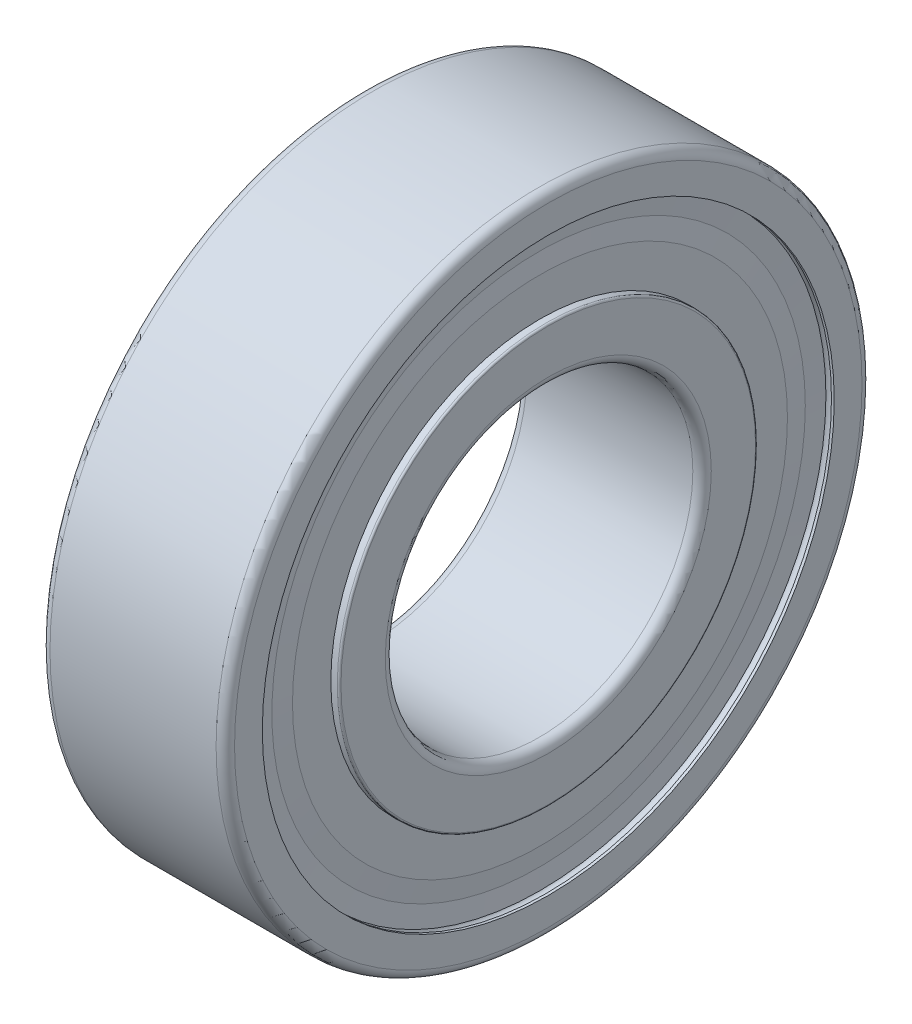
ISO-10303-21;
HEADER;
FILE_DESCRIPTION(('STEP AP214'),'2;1');
FILE_NAME('part.step','',(''),(''),'','','');
FILE_SCHEMA(('AUTOMOTIVE_DESIGN { 1 0 10303 214 1 1 1 1 }'));
ENDSEC;
DATA;
#1=APPLICATION_CONTEXT('core data for automotive mechanical design processes');
#2=APPLICATION_PROTOCOL_DEFINITION('international standard','automotive_design',2000,#1);
#3=PRODUCT_CONTEXT('',#1,'mechanical');
#4=PRODUCT('Part','Part','',(#3));
#5=PRODUCT_RELATED_PRODUCT_CATEGORY('part','',(#4));
#6=PRODUCT_DEFINITION_FORMATION('','',#4);
#7=PRODUCT_DEFINITION_CONTEXT('part definition',#1,'design');
#8=PRODUCT_DEFINITION('design','',#6,#7);
#9=PRODUCT_DEFINITION_SHAPE('','',#8);
#10=(LENGTH_UNIT() NAMED_UNIT(*) SI_UNIT(.MILLI.,.METRE.));
#11=(NAMED_UNIT(*) PLANE_ANGLE_UNIT() SI_UNIT($,.RADIAN.));
#12=(NAMED_UNIT(*) SI_UNIT($,.STERADIAN.) SOLID_ANGLE_UNIT());
#13=UNCERTAINTY_MEASURE_WITH_UNIT(LENGTH_MEASURE(1.E-05),#10,'distance_accuracy_value','');
#14=(GEOMETRIC_REPRESENTATION_CONTEXT(3) GLOBAL_UNCERTAINTY_ASSIGNED_CONTEXT((#13)) GLOBAL_UNIT_ASSIGNED_CONTEXT((#10,
#11,#12)) REPRESENTATION_CONTEXT('',''));
#15=CARTESIAN_POINT('',(0.,0.,0.));
#16=DIRECTION('',(0.,0.,1.));
#17=DIRECTION('',(1.,0.,0.));
#18=AXIS2_PLACEMENT_3D('',#15,#16,#17);
#19=CARTESIAN_POINT('',(50.,0.,0.));
#20=DIRECTION('',(1.,0.,0.));
#21=DIRECTION('',(0.,0.,-1.));
#22=AXIS2_PLACEMENT_3D('',#19,#20,#21);
#23=CYLINDRICAL_SURFACE('',#22,18.595);
#24=CARTESIAN_POINT('',(11.46,0.,0.));
#25=DIRECTION('',(1.,0.,0.));
#26=DIRECTION('',(0.,0.,-1.));
#27=AXIS2_PLACEMENT_3D('',#24,#25,#26);
#28=CIRCLE('',#27,18.595);
#29=CARTESIAN_POINT('',(11.46,0.,-18.595));
#30=VERTEX_POINT('',#29);
#31=EDGE_CURVE('P0_E11',#30,#30,#28,.T.);
#32=ORIENTED_EDGE('',*,*,#31,.F.);
#33=EDGE_LOOP('',(#32));
#34=FACE_BOUND('',#33,.T.);
#35=CARTESIAN_POINT('',(11.28,0.,0.));
#36=DIRECTION('',(1.,0.,0.));
#37=DIRECTION('',(0.,0.,-1.));
#38=AXIS2_PLACEMENT_3D('',#35,#36,#37);
#39=CIRCLE('',#38,18.595);
#40=CARTESIAN_POINT('',(11.28,0.,-18.595));
#41=VERTEX_POINT('',#40);
#42=EDGE_CURVE('P0_E186',#41,#41,#39,.T.);
#43=ORIENTED_EDGE('',*,*,#42,.T.);
#44=EDGE_LOOP('',(#43));
#45=FACE_BOUND('',#44,.T.);
#46=ADVANCED_FACE('P0_F16',(#34,#45),#23,.T.);
#47=CARTESIAN_POINT('',(11.37,0.,0.));
#48=DIRECTION('',(1.,0.,0.));
#49=DIRECTION('',(0.,0.,-1.));
#50=AXIS2_PLACEMENT_3D('',#47,#48,#49);
#51=CONICAL_SURFACE('',#50,17.34375,1.49899191472693);
#52=CARTESIAN_POINT('',(11.37,0.,0.));
#53=DIRECTION('',(1.,0.,0.));
#54=DIRECTION('',(0.,0.,-1.));
#55=AXIS2_PLACEMENT_3D('',#52,#53,#54);
#56=CIRCLE('',#55,17.34375);
#57=CARTESIAN_POINT('',(11.37,0.,-17.34375));
#58=VERTEX_POINT('',#57);
#59=EDGE_CURVE('P0_E27',#58,#58,#56,.T.);
#60=ORIENTED_EDGE('',*,*,#59,.F.);
#61=EDGE_LOOP('',(#60));
#62=FACE_BOUND('',#61,.T.);
#63=ORIENTED_EDGE('',*,*,#31,.T.);
#64=EDGE_LOOP('',(#63));
#65=FACE_BOUND('',#64,.T.);
#66=ADVANCED_FACE('P0_F267',(#62,#65),#51,.F.);
#67=CARTESIAN_POINT('',(11.46,0.,0.));
#68=DIRECTION('',(-1.,0.,0.));
#69=DIRECTION('',(0.,0.,1.));
#70=AXIS2_PLACEMENT_3D('',#67,#68,#69);
#71=CONICAL_SURFACE('',#70,16.0925,1.49899191472693);
#72=CARTESIAN_POINT('',(11.46,0.,0.));
#73=DIRECTION('',(1.,0.,0.));
#74=DIRECTION('',(0.,0.,-1.));
#75=AXIS2_PLACEMENT_3D('',#72,#73,#74);
#76=CIRCLE('',#75,16.0925);
#77=CARTESIAN_POINT('',(11.46,0.,-16.0925));
#78=VERTEX_POINT('',#77);
#79=EDGE_CURVE('P0_E168',#78,#78,#76,.T.);
#80=ORIENTED_EDGE('',*,*,#79,.F.);
#81=EDGE_LOOP('',(#80));
#82=FACE_BOUND('',#81,.T.);
#83=ORIENTED_EDGE('',*,*,#59,.T.);
#84=EDGE_LOOP('',(#83));
#85=FACE_BOUND('',#84,.T.);
#86=ADVANCED_FACE('P0_F18',(#82,#85),#71,.T.);
#87=CARTESIAN_POINT('',(11.46,13.59,0.));
#88=DIRECTION('',(1.,0.,0.));
#89=DIRECTION('',(0.,1.,0.));
#90=AXIS2_PLACEMENT_3D('',#87,#88,#89);
#91=PLANE('',#90);
#92=CARTESIAN_POINT('',(11.46,0.,0.));
#93=DIRECTION('',(-1.,0.,0.));
#94=DIRECTION('',(0.,0.,-1.));
#95=AXIS2_PLACEMENT_3D('',#92,#93,#94);
#96=CIRCLE('',#95,13.6);
#97=CARTESIAN_POINT('',(11.46,0.,-13.6));
#98=VERTEX_POINT('',#97);
#99=EDGE_CURVE('P0_E90',#98,#98,#96,.T.);
#100=ORIENTED_EDGE('',*,*,#99,.T.);
#101=EDGE_LOOP('',(#100));
#102=FACE_BOUND('',#101,.T.);
#103=ORIENTED_EDGE('',*,*,#79,.T.);
#104=EDGE_LOOP('',(#103));
#105=FACE_BOUND('',#104,.T.);
#106=ADVANCED_FACE('P0_F297',(#102,#105),#91,.T.);
#107=CARTESIAN_POINT('',(11.1,0.,0.));
#108=DIRECTION('',(-1.,0.,0.));
#109=DIRECTION('',(0.,0.,1.));
#110=AXIS2_PLACEMENT_3D('',#107,#108,#109);
#111=CONICAL_SURFACE('',#110,16.0925,1.49899191472693);
#112=CARTESIAN_POINT('',(11.1,0.,0.));
#113=DIRECTION('',(1.,0.,0.));
#114=DIRECTION('',(0.,0.,-1.));
#115=AXIS2_PLACEMENT_3D('',#112,#113,#114);
#116=CIRCLE('',#115,16.0925);
#117=CARTESIAN_POINT('',(11.1,0.,-16.0925));
#118=VERTEX_POINT('',#117);
#119=EDGE_CURVE('P0_E20',#118,#118,#116,.T.);
#120=ORIENTED_EDGE('',*,*,#119,.F.);
#121=EDGE_LOOP('',(#120));
#122=FACE_BOUND('',#121,.T.);
#123=CARTESIAN_POINT('',(11.2792807192807,0.,0.));
#124=DIRECTION('',(1.,0.,0.));
#125=DIRECTION('',(0.,0.,1.));
#126=AXIS2_PLACEMENT_3D('',#123,#124,#125);
#127=CIRCLE('',#126,13.6);
#128=CARTESIAN_POINT('',(11.2792807192807,0.,13.6));
#129=VERTEX_POINT('',#128);
#130=EDGE_CURVE('P0_E176',#129,#129,#127,.T.);
#131=ORIENTED_EDGE('',*,*,#130,.T.);
#132=EDGE_LOOP('',(#131));
#133=FACE_BOUND('',#132,.T.);
#134=ADVANCED_FACE('P0_F222',(#122,#133),#111,.F.);
#135=CARTESIAN_POINT('',(11.1,17.34375,0.));
#136=DIRECTION('',(-1.,0.,0.));
#137=DIRECTION('',(0.,0.,1.));
#138=AXIS2_PLACEMENT_3D('',#135,#136,#137);
#139=PLANE('',#138);
#140=CARTESIAN_POINT('',(11.1,0.,0.));
#141=DIRECTION('',(1.,0.,0.));
#142=DIRECTION('',(0.,0.,-1.));
#143=AXIS2_PLACEMENT_3D('',#140,#141,#142);
#144=CIRCLE('',#143,17.34375);
#145=CARTESIAN_POINT('',(11.1,0.,-17.34375));
#146=VERTEX_POINT('',#145);
#147=EDGE_CURVE('P0_E184',#146,#146,#144,.T.);
#148=ORIENTED_EDGE('',*,*,#147,.F.);
#149=EDGE_LOOP('',(#148));
#150=FACE_BOUND('',#149,.T.);
#151=ORIENTED_EDGE('',*,*,#119,.T.);
#152=EDGE_LOOP('',(#151));
#153=FACE_BOUND('',#152,.T.);
#154=ADVANCED_FACE('P0_F219',(#150,#153),#139,.T.);
#155=CARTESIAN_POINT('',(11.28,0.,0.));
#156=DIRECTION('',(1.,0.,0.));
#157=DIRECTION('',(0.,0.,-1.));
#158=AXIS2_PLACEMENT_3D('',#155,#156,#157);
#159=CONICAL_SURFACE('',#158,18.595,1.42792038843124);
#160=ORIENTED_EDGE('',*,*,#42,.F.);
#161=EDGE_LOOP('',(#160));
#162=FACE_BOUND('',#161,.T.);
#163=ORIENTED_EDGE('',*,*,#147,.T.);
#164=EDGE_LOOP('',(#163));
#165=FACE_BOUND('',#164,.T.);
#166=ADVANCED_FACE('P0_F217',(#162,#165),#159,.T.);
#167=CARTESIAN_POINT('',(0.9,0.,0.));
#168=DIRECTION('',(-1.,0.,0.));
#169=DIRECTION('',(0.,0.,1.));
#170=AXIS2_PLACEMENT_3D('',#167,#168,#169);
#171=CONICAL_SURFACE('',#170,17.34375,1.42792038843124);
#172=CARTESIAN_POINT('',(0.9,0.,0.));
#173=DIRECTION('',(1.,0.,0.));
#174=DIRECTION('',(0.,0.,-1.));
#175=AXIS2_PLACEMENT_3D('',#172,#173,#174);
#176=CIRCLE('',#175,17.34375);
#177=CARTESIAN_POINT('',(0.9,0.,-17.34375));
#178=VERTEX_POINT('',#177);
#179=EDGE_CURVE('P0_E181',#178,#178,#176,.T.);
#180=ORIENTED_EDGE('',*,*,#179,.F.);
#181=EDGE_LOOP('',(#180));
#182=FACE_BOUND('',#181,.T.);
#183=CARTESIAN_POINT('',(0.72,0.,0.));
#184=DIRECTION('',(1.,0.,0.));
#185=DIRECTION('',(0.,0.,-1.));
#186=AXIS2_PLACEMENT_3D('',#183,#184,#185);
#187=CIRCLE('',#186,18.595);
#188=CARTESIAN_POINT('',(0.72,0.,-18.595));
#189=VERTEX_POINT('',#188);
#190=EDGE_CURVE('P0_E192',#189,#189,#187,.T.);
#191=ORIENTED_EDGE('',*,*,#190,.T.);
#192=EDGE_LOOP('',(#191));
#193=FACE_BOUND('',#192,.T.);
#194=ADVANCED_FACE('P0_F315',(#182,#193),#171,.T.);
#195=CARTESIAN_POINT('',(0.9,16.0925,0.));
#196=DIRECTION('',(1.,0.,0.));
#197=DIRECTION('',(0.,1.,0.));
#198=AXIS2_PLACEMENT_3D('',#195,#196,#197);
#199=PLANE('',#198);
#200=CARTESIAN_POINT('',(0.9,0.,0.));
#201=DIRECTION('',(1.,0.,0.));
#202=DIRECTION('',(0.,0.,-1.));
#203=AXIS2_PLACEMENT_3D('',#200,#201,#202);
#204=CIRCLE('',#203,16.0925);
#205=CARTESIAN_POINT('',(0.9,0.,-16.0925));
#206=VERTEX_POINT('',#205);
#207=EDGE_CURVE('P0_E185',#206,#206,#204,.T.);
#208=ORIENTED_EDGE('',*,*,#207,.F.);
#209=EDGE_LOOP('',(#208));
#210=FACE_BOUND('',#209,.T.);
#211=ORIENTED_EDGE('',*,*,#179,.T.);
#212=EDGE_LOOP('',(#211));
#213=FACE_BOUND('',#212,.T.);
#214=ADVANCED_FACE('P0_F283',(#210,#213),#199,.T.);
#215=CARTESIAN_POINT('',(0.72,0.,0.));
#216=DIRECTION('',(1.,0.,0.));
#217=DIRECTION('',(0.,0.,-1.));
#218=AXIS2_PLACEMENT_3D('',#215,#216,#217);
#219=CONICAL_SURFACE('',#218,13.59,1.49899191472693);
#220=CARTESIAN_POINT('',(0.720719280719279,0.,0.));
#221=DIRECTION('',(-1.,0.,0.));
#222=DIRECTION('',(0.,0.,-1.));
#223=AXIS2_PLACEMENT_3D('',#220,#221,#222);
#224=CIRCLE('',#223,13.6);
#225=CARTESIAN_POINT('',(0.720719280719279,0.,-13.6));
#226=VERTEX_POINT('',#225);
#227=EDGE_CURVE('P0_E202',#226,#226,#224,.T.);
#228=ORIENTED_EDGE('',*,*,#227,.T.);
#229=EDGE_LOOP('',(#228));
#230=FACE_BOUND('',#229,.T.);
#231=ORIENTED_EDGE('',*,*,#207,.T.);
#232=EDGE_LOOP('',(#231));
#233=FACE_BOUND('',#232,.T.);
#234=ADVANCED_FACE('P0_F279',(#230,#233),#219,.F.);
#235=CARTESIAN_POINT('',(0.54,16.0925,0.));
#236=DIRECTION('',(-1.,0.,0.));
#237=DIRECTION('',(0.,0.,1.));
#238=AXIS2_PLACEMENT_3D('',#235,#236,#237);
#239=PLANE('',#238);
#240=CARTESIAN_POINT('',(0.54,0.,0.));
#241=DIRECTION('',(1.,0.,0.));
#242=DIRECTION('',(0.,0.,-1.));
#243=AXIS2_PLACEMENT_3D('',#240,#241,#242);
#244=CIRCLE('',#243,16.0925);
#245=CARTESIAN_POINT('',(0.54,0.,-16.0925));
#246=VERTEX_POINT('',#245);
#247=EDGE_CURVE('P0_E189',#246,#246,#244,.T.);
#248=ORIENTED_EDGE('',*,*,#247,.F.);
#249=EDGE_LOOP('',(#248));
#250=FACE_BOUND('',#249,.T.);
#251=CARTESIAN_POINT('',(0.54,0.,0.));
#252=DIRECTION('',(1.,0.,0.));
#253=DIRECTION('',(0.,0.,1.));
#254=AXIS2_PLACEMENT_3D('',#251,#252,#253);
#255=CIRCLE('',#254,13.6);
#256=CARTESIAN_POINT('',(0.54,0.,13.6));
#257=VERTEX_POINT('',#256);
#258=EDGE_CURVE('P0_E171',#257,#257,#255,.T.);
#259=ORIENTED_EDGE('',*,*,#258,.T.);
#260=EDGE_LOOP('',(#259));
#261=FACE_BOUND('',#260,.T.);
#262=ADVANCED_FACE('P0_F282',(#250,#261),#239,.T.);
#263=CARTESIAN_POINT('',(0.63,0.,0.));
#264=DIRECTION('',(1.,0.,0.));
#265=DIRECTION('',(0.,0.,-1.));
#266=AXIS2_PLACEMENT_3D('',#263,#264,#265);
#267=CONICAL_SURFACE('',#266,17.34375,1.49899191472693);
#268=CARTESIAN_POINT('',(0.63,0.,0.));
#269=DIRECTION('',(1.,0.,0.));
#270=DIRECTION('',(0.,0.,-1.));
#271=AXIS2_PLACEMENT_3D('',#268,#269,#270);
#272=CIRCLE('',#271,17.34375);
#273=CARTESIAN_POINT('',(0.63,0.,-17.34375));
#274=VERTEX_POINT('',#273);
#275=EDGE_CURVE('P0_E191',#274,#274,#272,.T.);
#276=ORIENTED_EDGE('',*,*,#275,.F.);
#277=EDGE_LOOP('',(#276));
#278=FACE_BOUND('',#277,.T.);
#279=ORIENTED_EDGE('',*,*,#247,.T.);
#280=EDGE_LOOP('',(#279));
#281=FACE_BOUND('',#280,.T.);
#282=ADVANCED_FACE('P0_F303',(#278,#281),#267,.T.);
#283=CARTESIAN_POINT('',(0.54,0.,0.));
#284=DIRECTION('',(-1.,0.,0.));
#285=DIRECTION('',(0.,0.,1.));
#286=AXIS2_PLACEMENT_3D('',#283,#284,#285);
#287=CONICAL_SURFACE('',#286,18.595,1.49899191472693);
#288=CARTESIAN_POINT('',(0.54,0.,0.));
#289=DIRECTION('',(1.,0.,0.));
#290=DIRECTION('',(0.,0.,-1.));
#291=AXIS2_PLACEMENT_3D('',#288,#289,#290);
#292=CIRCLE('',#291,18.595);
#293=CARTESIAN_POINT('',(0.54,0.,-18.595));
#294=VERTEX_POINT('',#293);
#295=EDGE_CURVE('P0_E194',#294,#294,#292,.T.);
#296=ORIENTED_EDGE('',*,*,#295,.F.);
#297=EDGE_LOOP('',(#296));
#298=FACE_BOUND('',#297,.T.);
#299=ORIENTED_EDGE('',*,*,#275,.T.);
#300=EDGE_LOOP('',(#299));
#301=FACE_BOUND('',#300,.T.);
#302=ADVANCED_FACE('P0_F306',(#298,#301),#287,.F.);
#303=CARTESIAN_POINT('',(50.,0.,0.));
#304=DIRECTION('',(1.,0.,0.));
#305=DIRECTION('',(0.,0.,-1.));
#306=AXIS2_PLACEMENT_3D('',#303,#304,#305);
#307=CYLINDRICAL_SURFACE('',#306,18.595);
#308=ORIENTED_EDGE('',*,*,#190,.F.);
#309=EDGE_LOOP('',(#308));
#310=FACE_BOUND('',#309,.T.);
#311=ORIENTED_EDGE('',*,*,#295,.T.);
#312=EDGE_LOOP('',(#311));
#313=FACE_BOUND('',#312,.T.);
#314=ADVANCED_FACE('P0_F262',(#310,#313),#307,.T.);
#315=CARTESIAN_POINT('',(50.,0.,0.));
#316=DIRECTION('',(1.,0.,0.));
#317=DIRECTION('',(0.,0.,-1.));
#318=AXIS2_PLACEMENT_3D('',#315,#316,#317);
#319=CYLINDRICAL_SURFACE('',#318,13.6);
#320=CARTESIAN_POINT('',(3.45625767814427,0.,0.));
#321=DIRECTION('',(1.,0.,0.));
#322=DIRECTION('',(0.,0.,-1.));
#323=AXIS2_PLACEMENT_3D('',#320,#321,#322);
#324=CIRCLE('',#323,13.6);
#325=CARTESIAN_POINT('',(3.45625767814427,0.,-13.6));
#326=VERTEX_POINT('',#325);
#327=EDGE_CURVE('P0_E209',#326,#326,#324,.T.);
#328=ORIENTED_EDGE('',*,*,#327,.F.);
#329=EDGE_LOOP('',(#328));
#330=FACE_BOUND('',#329,.T.);
#331=ORIENTED_EDGE('',*,*,#227,.F.);
#332=EDGE_LOOP('',(#331));
#333=FACE_BOUND('',#332,.T.);
#334=ADVANCED_FACE('P0_F250',(#330,#333),#319,.T.);
#335=CARTESIAN_POINT('',(6.,0.,0.));
#336=DIRECTION('',(1.,0.,0.));
#337=DIRECTION('',(0.,0.,-1.));
#338=AXIS2_PLACEMENT_3D('',#335,#336,#337);
#339=TOROIDAL_SURFACE('',#338,15.5,3.175);
#340=ORIENTED_EDGE('',*,*,#327,.T.);
#341=EDGE_LOOP('',(#340));
#342=FACE_BOUND('',#341,.T.);
#343=CARTESIAN_POINT('',(8.54374232185574,0.,0.));
#344=DIRECTION('',(1.,0.,0.));
#345=DIRECTION('',(0.,0.,-1.));
#346=AXIS2_PLACEMENT_3D('',#343,#344,#345);
#347=CIRCLE('',#346,13.6);
#348=CARTESIAN_POINT('',(8.54374232185574,0.,-13.6));
#349=VERTEX_POINT('',#348);
#350=EDGE_CURVE('P0_E180',#349,#349,#347,.T.);
#351=ORIENTED_EDGE('',*,*,#350,.F.);
#352=EDGE_LOOP('',(#351));
#353=FACE_BOUND('',#352,.T.);
#354=ADVANCED_FACE('P0_F247',(#342,#353),#339,.F.);
#355=CARTESIAN_POINT('',(50.,0.,0.));
#356=DIRECTION('',(1.,0.,0.));
#357=DIRECTION('',(0.,0.,-1.));
#358=AXIS2_PLACEMENT_3D('',#355,#356,#357);
#359=CYLINDRICAL_SURFACE('',#358,13.6);
#360=CARTESIAN_POINT('',(11.88,0.,0.));
#361=DIRECTION('',(1.,0.,0.));
#362=DIRECTION('',(0.,0.,-1.));
#363=AXIS2_PLACEMENT_3D('',#360,#361,#362);
#364=CIRCLE('',#363,13.6);
#365=CARTESIAN_POINT('',(11.88,0.,-13.6));
#366=VERTEX_POINT('',#365);
#367=EDGE_CURVE('P0_E103',#366,#366,#364,.T.);
#368=ORIENTED_EDGE('',*,*,#367,.F.);
#369=EDGE_LOOP('',(#368));
#370=FACE_BOUND('',#369,.T.);
#371=ORIENTED_EDGE('',*,*,#99,.F.);
#372=EDGE_LOOP('',(#371));
#373=FACE_BOUND('',#372,.T.);
#374=ADVANCED_FACE('P0_F249',(#370,#373),#359,.T.);
#375=CARTESIAN_POINT('',(11.88,0.,0.));
#376=DIRECTION('',(1.,0.,0.));
#377=DIRECTION('',(0.,0.,-1.));
#378=AXIS2_PLACEMENT_3D('',#375,#376,#377);
#379=TOROIDAL_SURFACE('',#378,13.48,0.12);
#380=CARTESIAN_POINT('',(12.,0.,0.));
#381=DIRECTION('',(1.,0.,0.));
#382=DIRECTION('',(0.,0.,-1.));
#383=AXIS2_PLACEMENT_3D('',#380,#381,#382);
#384=CIRCLE('',#383,13.48);
#385=CARTESIAN_POINT('',(12.,0.,-13.48));
#386=VERTEX_POINT('',#385);
#387=EDGE_CURVE('P0_E151',#386,#386,#384,.T.);
#388=ORIENTED_EDGE('',*,*,#387,.F.);
#389=EDGE_LOOP('',(#388));
#390=FACE_BOUND('',#389,.T.);
#391=ORIENTED_EDGE('',*,*,#367,.T.);
#392=EDGE_LOOP('',(#391));
#393=FACE_BOUND('',#392,.T.);
#394=ADVANCED_FACE('P0_F259',(#390,#393),#379,.T.);
#395=CARTESIAN_POINT('',(12.,10.6,0.));
#396=DIRECTION('',(1.,0.,0.));
#397=DIRECTION('',(0.,1.,0.));
#398=AXIS2_PLACEMENT_3D('',#395,#396,#397);
#399=PLANE('',#398);
#400=CARTESIAN_POINT('',(12.,0.,0.));
#401=DIRECTION('',(1.,0.,0.));
#402=DIRECTION('',(0.,0.,-1.));
#403=AXIS2_PLACEMENT_3D('',#400,#401,#402);
#404=CIRCLE('',#403,10.6);
#405=CARTESIAN_POINT('',(12.,0.,-10.6));
#406=VERTEX_POINT('',#405);
#407=EDGE_CURVE('P0_E143',#406,#406,#404,.T.);
#408=ORIENTED_EDGE('',*,*,#407,.F.);
#409=EDGE_LOOP('',(#408));
#410=FACE_BOUND('',#409,.T.);
#411=ORIENTED_EDGE('',*,*,#387,.T.);
#412=EDGE_LOOP('',(#411));
#413=FACE_BOUND('',#412,.T.);
#414=ADVANCED_FACE('P0_F298',(#410,#413),#399,.T.);
#415=CARTESIAN_POINT('',(11.4,0.,0.));
#416=DIRECTION('',(1.,0.,0.));
#417=DIRECTION('',(0.,0.,-1.));
#418=AXIS2_PLACEMENT_3D('',#415,#416,#417);
#419=TOROIDAL_SURFACE('',#418,10.6,0.6);
#420=CARTESIAN_POINT('',(11.4,0.,0.));
#421=DIRECTION('',(1.,0.,0.));
#422=DIRECTION('',(0.,0.,-1.));
#423=AXIS2_PLACEMENT_3D('',#420,#421,#422);
#424=CIRCLE('',#423,10.);
#425=CARTESIAN_POINT('',(11.4,0.,-10.));
#426=VERTEX_POINT('',#425);
#427=EDGE_CURVE('P0_E139',#426,#426,#424,.T.);
#428=ORIENTED_EDGE('',*,*,#427,.F.);
#429=EDGE_LOOP('',(#428));
#430=FACE_BOUND('',#429,.T.);
#431=ORIENTED_EDGE('',*,*,#407,.T.);
#432=EDGE_LOOP('',(#431));
#433=FACE_BOUND('',#432,.T.);
#434=ADVANCED_FACE('P0_F301',(#430,#433),#419,.T.);
#435=CARTESIAN_POINT('',(50.,0.,0.));
#436=DIRECTION('',(1.,0.,0.));
#437=DIRECTION('',(0.,0.,-1.));
#438=AXIS2_PLACEMENT_3D('',#435,#436,#437);
#439=CYLINDRICAL_SURFACE('',#438,10.);
#440=CARTESIAN_POINT('',(0.6,0.,0.));
#441=DIRECTION('',(1.,0.,0.));
#442=DIRECTION('',(0.,0.,-1.));
#443=AXIS2_PLACEMENT_3D('',#440,#441,#442);
#444=CIRCLE('',#443,10.);
#445=CARTESIAN_POINT('',(0.6,0.,-10.));
#446=VERTEX_POINT('',#445);
#447=EDGE_CURVE('P0_E144',#446,#446,#444,.T.);
#448=ORIENTED_EDGE('',*,*,#447,.F.);
#449=EDGE_LOOP('',(#448));
#450=FACE_BOUND('',#449,.T.);
#451=ORIENTED_EDGE('',*,*,#427,.T.);
#452=EDGE_LOOP('',(#451));
#453=FACE_BOUND('',#452,.T.);
#454=ADVANCED_FACE('P0_F140',(#450,#453),#439,.F.);
#455=CARTESIAN_POINT('',(0.6,0.,0.));
#456=DIRECTION('',(1.,0.,0.));
#457=DIRECTION('',(0.,0.,-1.));
#458=AXIS2_PLACEMENT_3D('',#455,#456,#457);
#459=TOROIDAL_SURFACE('',#458,10.6,0.6);
#460=CARTESIAN_POINT('',(0.,0.,0.));
#461=DIRECTION('',(1.,0.,0.));
#462=DIRECTION('',(0.,0.,-1.));
#463=AXIS2_PLACEMENT_3D('',#460,#461,#462);
#464=CIRCLE('',#463,10.6);
#465=CARTESIAN_POINT('',(0.,0.,-10.6));
#466=VERTEX_POINT('',#465);
#467=EDGE_CURVE('P0_E153',#466,#466,#464,.T.);
#468=ORIENTED_EDGE('',*,*,#467,.F.);
#469=EDGE_LOOP('',(#468));
#470=FACE_BOUND('',#469,.T.);
#471=ORIENTED_EDGE('',*,*,#447,.T.);
#472=EDGE_LOOP('',(#471));
#473=FACE_BOUND('',#472,.T.);
#474=ADVANCED_FACE('P0_F285',(#470,#473),#459,.T.);
#475=CARTESIAN_POINT('',(0.,13.48,0.));
#476=DIRECTION('',(-1.,0.,0.));
#477=DIRECTION('',(0.,0.,1.));
#478=AXIS2_PLACEMENT_3D('',#475,#476,#477);
#479=PLANE('',#478);
#480=CARTESIAN_POINT('',(0.,0.,0.));
#481=DIRECTION('',(1.,0.,0.));
#482=DIRECTION('',(0.,0.,-1.));
#483=AXIS2_PLACEMENT_3D('',#480,#481,#482);
#484=CIRCLE('',#483,13.48);
#485=CARTESIAN_POINT('',(0.,0.,-13.48));
#486=VERTEX_POINT('',#485);
#487=EDGE_CURVE('P0_E161',#486,#486,#484,.T.);
#488=ORIENTED_EDGE('',*,*,#487,.F.);
#489=EDGE_LOOP('',(#488));
#490=FACE_BOUND('',#489,.T.);
#491=ORIENTED_EDGE('',*,*,#467,.T.);
#492=EDGE_LOOP('',(#491));
#493=FACE_BOUND('',#492,.T.);
#494=ADVANCED_FACE('P0_F288',(#490,#493),#479,.T.);
#495=CARTESIAN_POINT('',(0.12,0.,0.));
#496=DIRECTION('',(1.,0.,0.));
#497=DIRECTION('',(0.,0.,-1.));
#498=AXIS2_PLACEMENT_3D('',#495,#496,#497);
#499=TOROIDAL_SURFACE('',#498,13.48,0.12);
#500=CARTESIAN_POINT('',(0.120000000000002,0.,0.));
#501=DIRECTION('',(1.,0.,0.));
#502=DIRECTION('',(0.,0.,-1.));
#503=AXIS2_PLACEMENT_3D('',#500,#501,#502);
#504=CIRCLE('',#503,13.6);
#505=CARTESIAN_POINT('',(0.120000000000002,0.,-13.6));
#506=VERTEX_POINT('',#505);
#507=EDGE_CURVE('P0_E174',#506,#506,#504,.T.);
#508=ORIENTED_EDGE('',*,*,#507,.F.);
#509=EDGE_LOOP('',(#508));
#510=FACE_BOUND('',#509,.T.);
#511=ORIENTED_EDGE('',*,*,#487,.T.);
#512=EDGE_LOOP('',(#511));
#513=FACE_BOUND('',#512,.T.);
#514=ADVANCED_FACE('P0_F290',(#510,#513),#499,.T.);
#515=CARTESIAN_POINT('',(50.,0.,0.));
#516=DIRECTION('',(1.,0.,0.));
#517=DIRECTION('',(0.,0.,-1.));
#518=AXIS2_PLACEMENT_3D('',#515,#516,#517);
#519=CYLINDRICAL_SURFACE('',#518,13.6);
#520=ORIENTED_EDGE('',*,*,#258,.F.);
#521=EDGE_LOOP('',(#520));
#522=FACE_BOUND('',#521,.T.);
#523=ORIENTED_EDGE('',*,*,#507,.T.);
#524=EDGE_LOOP('',(#523));
#525=FACE_BOUND('',#524,.T.);
#526=ADVANCED_FACE('P0_F293',(#522,#525),#519,.T.);
#527=CARTESIAN_POINT('',(50.,0.,0.));
#528=DIRECTION('',(1.,0.,0.));
#529=DIRECTION('',(0.,0.,-1.));
#530=AXIS2_PLACEMENT_3D('',#527,#528,#529);
#531=CYLINDRICAL_SURFACE('',#530,13.6);
#532=ORIENTED_EDGE('',*,*,#130,.F.);
#533=EDGE_LOOP('',(#532));
#534=FACE_BOUND('',#533,.T.);
#535=ORIENTED_EDGE('',*,*,#350,.T.);
#536=EDGE_LOOP('',(#535));
#537=FACE_BOUND('',#536,.T.);
#538=ADVANCED_FACE('P0_F245',(#534,#537),#531,.T.);
#539=CLOSED_SHELL('',(#46,#66,#86,#106,#134,#154,#166,#194,#214,#234,#262,#282,#302,#314,#334,
#354,#374,#394,#414,#434,#454,#474,#494,#514,#526,#538));
#540=MANIFOLD_SOLID_BREP('P0_B1',#539);
#541=CARTESIAN_POINT('',(50.,0.,0.));
#542=DIRECTION('',(1.,0.,0.));
#543=DIRECTION('',(0.,0.,-1.));
#544=AXIS2_PLACEMENT_3D('',#541,#542,#543);
#545=CYLINDRICAL_SURFACE('',#544,21.);
#546=CARTESIAN_POINT('',(11.4,0.,0.));
#547=DIRECTION('',(1.,0.,0.));
#548=DIRECTION('',(0.,0.,-1.));
#549=AXIS2_PLACEMENT_3D('',#546,#547,#548);
#550=CIRCLE('',#549,21.);
#551=CARTESIAN_POINT('',(11.4,0.,-21.));
#552=VERTEX_POINT('',#551);
#553=EDGE_CURVE('P1_E11',#552,#552,#550,.T.);
#554=ORIENTED_EDGE('',*,*,#553,.F.);
#555=EDGE_LOOP('',(#554));
#556=FACE_BOUND('',#555,.T.);
#557=CARTESIAN_POINT('',(0.6,0.,0.));
#558=DIRECTION('',(1.,0.,0.));
#559=DIRECTION('',(0.,0.,-1.));
#560=AXIS2_PLACEMENT_3D('',#557,#558,#559);
#561=CIRCLE('',#560,21.);
#562=CARTESIAN_POINT('',(0.6,0.,-21.));
#563=VERTEX_POINT('',#562);
#564=EDGE_CURVE('P1_E117',#563,#563,#561,.T.);
#565=ORIENTED_EDGE('',*,*,#564,.T.);
#566=EDGE_LOOP('',(#565));
#567=FACE_BOUND('',#566,.T.);
#568=ADVANCED_FACE('P1_F16',(#556,#567),#545,.T.);
#569=CARTESIAN_POINT('',(11.4,0.,0.));
#570=DIRECTION('',(1.,0.,0.));
#571=DIRECTION('',(0.,0.,-1.));
#572=AXIS2_PLACEMENT_3D('',#569,#570,#571);
#573=TOROIDAL_SURFACE('',#572,20.4,0.600000000000007);
#574=CARTESIAN_POINT('',(12.,0.,0.));
#575=DIRECTION('',(1.,0.,0.));
#576=DIRECTION('',(0.,0.,-1.));
#577=AXIS2_PLACEMENT_3D('',#574,#575,#576);
#578=CIRCLE('',#577,20.4);
#579=CARTESIAN_POINT('',(12.,0.,-20.4));
#580=VERTEX_POINT('',#579);
#581=EDGE_CURVE('P1_E27',#580,#580,#578,.T.);
#582=ORIENTED_EDGE('',*,*,#581,.F.);
#583=EDGE_LOOP('',(#582));
#584=FACE_BOUND('',#583,.T.);
#585=ORIENTED_EDGE('',*,*,#553,.T.);
#586=EDGE_LOOP('',(#585));
#587=FACE_BOUND('',#586,.T.);
#588=ADVANCED_FACE('P1_F154',(#584,#587),#573,.T.);
#589=CARTESIAN_POINT('',(12.,18.595,0.));
#590=DIRECTION('',(1.,0.,0.));
#591=DIRECTION('',(0.,1.,0.));
#592=AXIS2_PLACEMENT_3D('',#589,#590,#591);
#593=PLANE('',#592);
#594=CARTESIAN_POINT('',(12.,0.,0.));
#595=DIRECTION('',(1.,0.,0.));
#596=DIRECTION('',(0.,0.,-1.));
#597=AXIS2_PLACEMENT_3D('',#594,#595,#596);
#598=CIRCLE('',#597,18.595);
#599=CARTESIAN_POINT('',(12.,0.,-18.595));
#600=VERTEX_POINT('',#599);
#601=EDGE_CURVE('P1_E112',#600,#600,#598,.T.);
#602=ORIENTED_EDGE('',*,*,#601,.F.);
#603=EDGE_LOOP('',(#602));
#604=FACE_BOUND('',#603,.T.);
#605=ORIENTED_EDGE('',*,*,#581,.T.);
#606=EDGE_LOOP('',(#605));
#607=FACE_BOUND('',#606,.T.);
#608=ADVANCED_FACE('P1_F150',(#604,#607),#593,.T.);
#609=CARTESIAN_POINT('',(50.,0.,0.));
#610=DIRECTION('',(1.,0.,0.));
#611=DIRECTION('',(0.,0.,-1.));
#612=AXIS2_PLACEMENT_3D('',#609,#610,#611);
#613=CYLINDRICAL_SURFACE('',#612,18.595);
#614=CARTESIAN_POINT('',(11.82,0.,0.));
#615=DIRECTION('',(1.,0.,0.));
#616=DIRECTION('',(0.,0.,-1.));
#617=AXIS2_PLACEMENT_3D('',#614,#615,#616);
#618=CIRCLE('',#617,18.595);
#619=CARTESIAN_POINT('',(11.82,0.,-18.595));
#620=VERTEX_POINT('',#619);
#621=EDGE_CURVE('P1_E109',#620,#620,#618,.T.);
#622=ORIENTED_EDGE('',*,*,#621,.F.);
#623=EDGE_LOOP('',(#622));
#624=FACE_BOUND('',#623,.T.);
#625=ORIENTED_EDGE('',*,*,#601,.T.);
#626=EDGE_LOOP('',(#625));
#627=FACE_BOUND('',#626,.T.);
#628=ADVANCED_FACE('P1_F139',(#624,#627),#613,.F.);
#629=CARTESIAN_POINT('',(11.46,0.,0.));
#630=DIRECTION('',(1.,0.,0.));
#631=DIRECTION('',(0.,0.,-1.));
#632=AXIS2_PLACEMENT_3D('',#629,#630,#631);
#633=TOROIDAL_SURFACE('',#632,18.5950000189953,0.36);
#634=ORIENTED_EDGE('',*,*,#621,.T.);
#635=EDGE_LOOP('',(#634));
#636=FACE_BOUND('',#635,.T.);
#637=CARTESIAN_POINT('',(11.1,0.,0.));
#638=DIRECTION('',(1.,0.,0.));
#639=DIRECTION('',(0.,0.,-1.));
#640=AXIS2_PLACEMENT_3D('',#637,#638,#639);
#641=CIRCLE('',#640,18.595);
#642=CARTESIAN_POINT('',(11.1,0.,-18.595));
#643=VERTEX_POINT('',#642);
#644=EDGE_CURVE('P1_E113',#643,#643,#641,.T.);
#645=ORIENTED_EDGE('',*,*,#644,.F.);
#646=EDGE_LOOP('',(#645));
#647=FACE_BOUND('',#646,.T.);
#648=ADVANCED_FACE('P1_F18',(#636,#647),#633,.F.);
#649=CARTESIAN_POINT('',(10.8892892580534,0.,0.));
#650=DIRECTION('',(1.,0.,0.));
#651=DIRECTION('',(0.,0.,-1.));
#652=AXIS2_PLACEMENT_3D('',#649,#650,#651);
#653=CONICAL_SURFACE('',#652,17.4,1.39626340159546);
#654=CARTESIAN_POINT('',(10.8892892580534,0.,0.));
#655=DIRECTION('',(1.,0.,0.));
#656=DIRECTION('',(0.,0.,-1.));
#657=AXIS2_PLACEMENT_3D('',#654,#655,#656);
#658=CIRCLE('',#657,17.4);
#659=CARTESIAN_POINT('',(10.8892892580534,0.,-17.4));
#660=VERTEX_POINT('',#659);
#661=EDGE_CURVE('P1_E97',#660,#660,#658,.T.);
#662=ORIENTED_EDGE('',*,*,#661,.F.);
#663=EDGE_LOOP('',(#662));
#664=FACE_BOUND('',#663,.T.);
#665=ORIENTED_EDGE('',*,*,#644,.T.);
#666=EDGE_LOOP('',(#665));
#667=FACE_BOUND('',#666,.T.);
#668=ADVANCED_FACE('P1_F136',(#664,#667),#653,.F.);
#669=CARTESIAN_POINT('',(50.,0.,0.));
#670=DIRECTION('',(1.,0.,0.));
#671=DIRECTION('',(0.,0.,-1.));
#672=AXIS2_PLACEMENT_3D('',#669,#670,#671);
#673=CYLINDRICAL_SURFACE('',#672,17.4);
#674=CARTESIAN_POINT('',(8.54374232185574,0.,0.));
#675=DIRECTION('',(1.,0.,0.));
#676=DIRECTION('',(0.,0.,-1.));
#677=AXIS2_PLACEMENT_3D('',#674,#675,#676);
#678=CIRCLE('',#677,17.4);
#679=CARTESIAN_POINT('',(8.54374232185574,0.,-17.4));
#680=VERTEX_POINT('',#679);
#681=EDGE_CURVE('P1_E90',#680,#680,#678,.T.);
#682=ORIENTED_EDGE('',*,*,#681,.F.);
#683=EDGE_LOOP('',(#682));
#684=FACE_BOUND('',#683,.T.);
#685=ORIENTED_EDGE('',*,*,#661,.T.);
#686=EDGE_LOOP('',(#685));
#687=FACE_BOUND('',#686,.T.);
#688=ADVANCED_FACE('P1_F147',(#684,#687),#673,.F.);
#689=CARTESIAN_POINT('',(6.,0.,0.));
#690=DIRECTION('',(1.,0.,0.));
#691=DIRECTION('',(0.,0.,-1.));
#692=AXIS2_PLACEMENT_3D('',#689,#690,#691);
#693=TOROIDAL_SURFACE('',#692,15.5,3.175);
#694=ORIENTED_EDGE('',*,*,#681,.T.);
#695=EDGE_LOOP('',(#694));
#696=FACE_BOUND('',#695,.T.);
#697=CARTESIAN_POINT('',(3.45625767814427,0.,0.));
#698=DIRECTION('',(1.,0.,0.));
#699=DIRECTION('',(0.,0.,-1.));
#700=AXIS2_PLACEMENT_3D('',#697,#698,#699);
#701=CIRCLE('',#700,17.4);
#702=CARTESIAN_POINT('',(3.45625767814427,0.,-17.4));
#703=VERTEX_POINT('',#702);
#704=EDGE_CURVE('P1_E20',#703,#703,#701,.T.);
#705=ORIENTED_EDGE('',*,*,#704,.F.);
#706=EDGE_LOOP('',(#705));
#707=FACE_BOUND('',#706,.T.);
#708=ADVANCED_FACE('P1_F182',(#696,#707),#693,.F.);
#709=CARTESIAN_POINT('',(50.,0.,0.));
#710=DIRECTION('',(1.,0.,0.));
#711=DIRECTION('',(0.,0.,-1.));
#712=AXIS2_PLACEMENT_3D('',#709,#710,#711);
#713=CYLINDRICAL_SURFACE('',#712,17.4);
#714=CARTESIAN_POINT('',(1.11071074194662,0.,0.));
#715=DIRECTION('',(1.,0.,0.));
#716=DIRECTION('',(0.,0.,-1.));
#717=AXIS2_PLACEMENT_3D('',#714,#715,#716);
#718=CIRCLE('',#717,17.4);
#719=CARTESIAN_POINT('',(1.11071074194662,0.,-17.4));
#720=VERTEX_POINT('',#719);
#721=EDGE_CURVE('P1_E91',#720,#720,#718,.T.);
#722=ORIENTED_EDGE('',*,*,#721,.F.);
#723=EDGE_LOOP('',(#722));
#724=FACE_BOUND('',#723,.T.);
#725=ORIENTED_EDGE('',*,*,#704,.T.);
#726=EDGE_LOOP('',(#725));
#727=FACE_BOUND('',#726,.T.);
#728=ADVANCED_FACE('P1_F87',(#724,#727),#713,.F.);
#729=CARTESIAN_POINT('',(0.9,0.,0.));
#730=DIRECTION('',(-1.,0.,0.));
#731=DIRECTION('',(0.,0.,1.));
#732=AXIS2_PLACEMENT_3D('',#729,#730,#731);
#733=CONICAL_SURFACE('',#732,18.595,1.39626340159547);
#734=CARTESIAN_POINT('',(0.9,0.,0.));
#735=DIRECTION('',(1.,0.,0.));
#736=DIRECTION('',(0.,0.,-1.));
#737=AXIS2_PLACEMENT_3D('',#734,#735,#736);
#738=CIRCLE('',#737,18.595);
#739=CARTESIAN_POINT('',(0.9,0.,-18.595));
#740=VERTEX_POINT('',#739);
#741=EDGE_CURVE('P1_E99',#740,#740,#738,.T.);
#742=ORIENTED_EDGE('',*,*,#741,.F.);
#743=EDGE_LOOP('',(#742));
#744=FACE_BOUND('',#743,.T.);
#745=ORIENTED_EDGE('',*,*,#721,.T.);
#746=EDGE_LOOP('',(#745));
#747=FACE_BOUND('',#746,.T.);
#748=ADVANCED_FACE('P1_F174',(#744,#747),#733,.F.);
#749=CARTESIAN_POINT('',(0.54,0.,0.));
#750=DIRECTION('',(1.,0.,0.));
#751=DIRECTION('',(0.,0.,-1.));
#752=AXIS2_PLACEMENT_3D('',#749,#750,#751);
#753=TOROIDAL_SURFACE('',#752,18.595,0.36);
#754=ORIENTED_EDGE('',*,*,#741,.T.);
#755=EDGE_LOOP('',(#754));
#756=FACE_BOUND('',#755,.T.);
#757=CARTESIAN_POINT('',(0.18,0.,0.));
#758=DIRECTION('',(1.,0.,0.));
#759=DIRECTION('',(0.,0.,-1.));
#760=AXIS2_PLACEMENT_3D('',#757,#758,#759);
#761=CIRCLE('',#760,18.595);
#762=CARTESIAN_POINT('',(0.18,0.,-18.595));
#763=VERTEX_POINT('',#762);
#764=EDGE_CURVE('P1_E106',#763,#763,#761,.T.);
#765=ORIENTED_EDGE('',*,*,#764,.F.);
#766=EDGE_LOOP('',(#765));
#767=FACE_BOUND('',#766,.T.);
#768=ADVANCED_FACE('P1_F171',(#756,#767),#753,.F.);
#769=CARTESIAN_POINT('',(50.,0.,0.));
#770=DIRECTION('',(1.,0.,0.));
#771=DIRECTION('',(0.,0.,-1.));
#772=AXIS2_PLACEMENT_3D('',#769,#770,#771);
#773=CYLINDRICAL_SURFACE('',#772,18.595);
#774=CARTESIAN_POINT('',(0.,0.,0.));
#775=DIRECTION('',(1.,0.,0.));
#776=DIRECTION('',(0.,0.,-1.));
#777=AXIS2_PLACEMENT_3D('',#774,#775,#776);
#778=CIRCLE('',#777,18.595);
#779=CARTESIAN_POINT('',(0.,0.,-18.595));
#780=VERTEX_POINT('',#779);
#781=EDGE_CURVE('P1_E123',#780,#780,#778,.T.);
#782=ORIENTED_EDGE('',*,*,#781,.F.);
#783=EDGE_LOOP('',(#782));
#784=FACE_BOUND('',#783,.T.);
#785=ORIENTED_EDGE('',*,*,#764,.T.);
#786=EDGE_LOOP('',(#785));
#787=FACE_BOUND('',#786,.T.);
#788=ADVANCED_FACE('P1_F173',(#784,#787),#773,.F.);
#789=CARTESIAN_POINT('',(0.,20.4,0.));
#790=DIRECTION('',(-1.,0.,0.));
#791=DIRECTION('',(0.,0.,1.));
#792=AXIS2_PLACEMENT_3D('',#789,#790,#791);
#793=PLANE('',#792);
#794=CARTESIAN_POINT('',(0.,0.,0.));
#795=DIRECTION('',(1.,0.,0.));
#796=DIRECTION('',(0.,0.,-1.));
#797=AXIS2_PLACEMENT_3D('',#794,#795,#796);
#798=CIRCLE('',#797,20.4);
#799=CARTESIAN_POINT('',(0.,0.,-20.4));
#800=VERTEX_POINT('',#799);
#801=EDGE_CURVE('P1_E114',#800,#800,#798,.T.);
#802=ORIENTED_EDGE('',*,*,#801,.F.);
#803=EDGE_LOOP('',(#802));
#804=FACE_BOUND('',#803,.T.);
#805=ORIENTED_EDGE('',*,*,#781,.T.);
#806=EDGE_LOOP('',(#805));
#807=FACE_BOUND('',#806,.T.);
#808=ADVANCED_FACE('P1_F166',(#804,#807),#793,.T.);
#809=CARTESIAN_POINT('',(0.6,0.,0.));
#810=DIRECTION('',(1.,0.,0.));
#811=DIRECTION('',(0.,0.,-1.));
#812=AXIS2_PLACEMENT_3D('',#809,#810,#811);
#813=TOROIDAL_SURFACE('',#812,20.4,0.600000000000007);
#814=ORIENTED_EDGE('',*,*,#564,.F.);
#815=EDGE_LOOP('',(#814));
#816=FACE_BOUND('',#815,.T.);
#817=ORIENTED_EDGE('',*,*,#801,.T.);
#818=EDGE_LOOP('',(#817));
#819=FACE_BOUND('',#818,.T.);
#820=ADVANCED_FACE('P1_F167',(#816,#819),#813,.T.);
#821=CLOSED_SHELL('',(#568,#588,#608,#628,#648,#668,#688,#708,#728,#748,#768,#788,#808,#820));
#822=MANIFOLD_SOLID_BREP('P1_B1',#821);
#823=CARTESIAN_POINT('',(6.,11.8736888683442,9.96320795014137));
#824=DIRECTION('',(1.,0.,0.));
#825=DIRECTION('',(0.,-0.766044443118978,-0.64278760968654));
#826=AXIS2_PLACEMENT_3D('',#823,#824,#825);
#827=SPHERICAL_SURFACE('',#826,3.175);
#828=CARTESIAN_POINT('',(2.825,11.8736888683442,9.96320795014137));
#829=VERTEX_POINT('',#828);
#830=VERTEX_LOOP('',#829);
#831=FACE_BOUND('',#830,.T.);
#832=ADVANCED_FACE('P2_F14',(#831),#827,.T.);
#833=CLOSED_SHELL('',(#832));
#834=MANIFOLD_SOLID_BREP('P2_B1',#833);
#835=CARTESIAN_POINT('',(6.,2.69154675383741,15.2645201716892));
#836=DIRECTION('',(1.,0.,0.));
#837=DIRECTION('',(0.,-0.17364817766693,-0.984807753012208));
#838=AXIS2_PLACEMENT_3D('',#835,#836,#837);
#839=SPHERICAL_SURFACE('',#838,3.175);
#840=CARTESIAN_POINT('',(2.825,2.69154675383741,15.2645201716892));
#841=VERTEX_POINT('',#840);
#842=VERTEX_LOOP('',#841);
#843=FACE_BOUND('',#842,.T.);
#844=ADVANCED_FACE('P3_F14',(#843),#839,.T.);
#845=CLOSED_SHELL('',(#844));
#846=MANIFOLD_SOLID_BREP('P3_B1',#845);
#847=CARTESIAN_POINT('',(6.,-7.75,13.4233937586588));
#848=DIRECTION('',(1.,0.,0.));
#849=DIRECTION('',(0.,0.5,-0.866025403784438));
#850=AXIS2_PLACEMENT_3D('',#847,#848,#849);
#851=SPHERICAL_SURFACE('',#850,3.175);
#852=CARTESIAN_POINT('',(2.825,-7.75,13.4233937586588));
#853=VERTEX_POINT('',#852);
#854=VERTEX_LOOP('',#853);
#855=FACE_BOUND('',#854,.T.);
#856=ADVANCED_FACE('P4_F14',(#855),#851,.T.);
#857=CLOSED_SHELL('',(#856));
#858=MANIFOLD_SOLID_BREP('P4_B1',#857);
#859=CARTESIAN_POINT('',(6.,-14.5652356221816,5.30131222154787));
#860=DIRECTION('',(1.,0.,0.));
#861=DIRECTION('',(0.,0.939692620785908,-0.342020143325669));
#862=AXIS2_PLACEMENT_3D('',#859,#860,#861);
#863=SPHERICAL_SURFACE('',#862,3.175);
#864=CARTESIAN_POINT('',(2.825,-14.5652356221816,5.30131222154787));
#865=VERTEX_POINT('',#864);
#866=VERTEX_LOOP('',#865);
#867=FACE_BOUND('',#866,.T.);
#868=ADVANCED_FACE('P5_F14',(#867),#863,.T.);
#869=CLOSED_SHELL('',(#868));
#870=MANIFOLD_SOLID_BREP('P5_B1',#869);
#871=CARTESIAN_POINT('',(6.,-14.5652356221816,-5.30131222154787));
#872=DIRECTION('',(1.,0.,0.));
#873=DIRECTION('',(0.,0.939692620785908,0.342020143325669));
#874=AXIS2_PLACEMENT_3D('',#871,#872,#873);
#875=SPHERICAL_SURFACE('',#874,3.175);
#876=CARTESIAN_POINT('',(2.825,-14.5652356221816,-5.30131222154787));
#877=VERTEX_POINT('',#876);
#878=VERTEX_LOOP('',#877);
#879=FACE_BOUND('',#878,.T.);
#880=ADVANCED_FACE('P6_F14',(#879),#875,.T.);
#881=CLOSED_SHELL('',(#880));
#882=MANIFOLD_SOLID_BREP('P6_B1',#881);
#883=CARTESIAN_POINT('',(6.,-7.75,-13.4233937586588));
#884=DIRECTION('',(1.,0.,0.));
#885=DIRECTION('',(0.,0.5,0.866025403784439));
#886=AXIS2_PLACEMENT_3D('',#883,#884,#885);
#887=SPHERICAL_SURFACE('',#886,3.175);
#888=CARTESIAN_POINT('',(2.825,-7.75,-13.4233937586588));
#889=VERTEX_POINT('',#888);
#890=VERTEX_LOOP('',#889);
#891=FACE_BOUND('',#890,.T.);
#892=ADVANCED_FACE('P7_F14',(#891),#887,.T.);
#893=CLOSED_SHELL('',(#892));
#894=MANIFOLD_SOLID_BREP('P7_B1',#893);
#895=CARTESIAN_POINT('',(6.,2.69154675383741,-15.2645201716892));
#896=DIRECTION('',(1.,0.,0.));
#897=DIRECTION('',(0.,-0.17364817766693,0.984807753012208));
#898=AXIS2_PLACEMENT_3D('',#895,#896,#897);
#899=SPHERICAL_SURFACE('',#898,3.175);
#900=CARTESIAN_POINT('',(2.825,2.69154675383741,-15.2645201716892));
#901=VERTEX_POINT('',#900);
#902=VERTEX_LOOP('',#901);
#903=FACE_BOUND('',#902,.T.);
#904=ADVANCED_FACE('P8_F14',(#903),#899,.T.);
#905=CLOSED_SHELL('',(#904));
#906=MANIFOLD_SOLID_BREP('P8_B1',#905);
#907=CARTESIAN_POINT('',(6.,11.8736888683442,-9.96320795014135));
#908=DIRECTION('',(1.,0.,0.));
#909=DIRECTION('',(0.,-0.766044443118978,0.642787609686539));
#910=AXIS2_PLACEMENT_3D('',#907,#908,#909);
#911=SPHERICAL_SURFACE('',#910,3.175);
#912=CARTESIAN_POINT('',(2.825,11.8736888683442,-9.96320795014135));
#913=VERTEX_POINT('',#912);
#914=VERTEX_LOOP('',#913);
#915=FACE_BOUND('',#914,.T.);
#916=ADVANCED_FACE('P9_F14',(#915),#911,.T.);
#917=CLOSED_SHELL('',(#916));
#918=MANIFOLD_SOLID_BREP('P9_B1',#917);
#919=CARTESIAN_POINT('',(6.,15.5,0.));
#920=DIRECTION('',(1.,0.,0.));
#921=DIRECTION('',(0.,-1.,0.));
#922=AXIS2_PLACEMENT_3D('',#919,#920,#921);
#923=SPHERICAL_SURFACE('',#922,3.175);
#924=CARTESIAN_POINT('',(2.825,15.5,0.));
#925=VERTEX_POINT('',#924);
#926=VERTEX_LOOP('',#925);
#927=FACE_BOUND('',#926,.T.);
#928=ADVANCED_FACE('P10_F14',(#927),#923,.T.);
#929=CLOSED_SHELL('',(#928));
#930=MANIFOLD_SOLID_BREP('P10_B1',#929);
#931=ADVANCED_BREP_SHAPE_REPRESENTATION('',(#18,#540,#822,#834,#846,#858,#870,#882,#894,#906,
#918,#930),#14);
#932=SHAPE_DEFINITION_REPRESENTATION(#9,#931);
ENDSEC;
END-ISO-10303-21;
